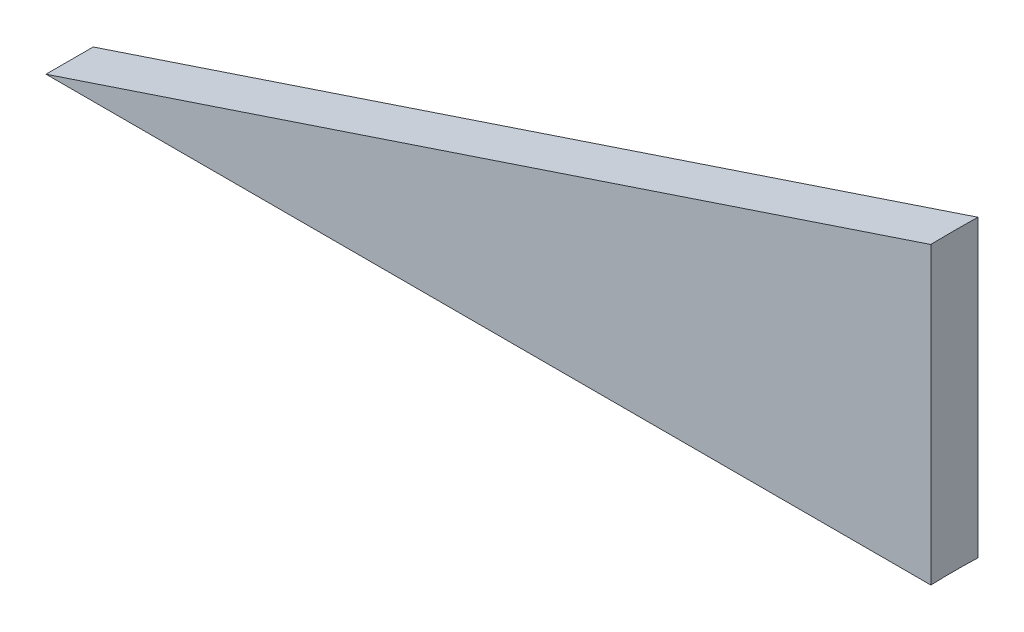
ISO-10303-21;
HEADER;
FILE_DESCRIPTION(('STEP AP214'),'2;1');
FILE_NAME('part.step','',(''),(''),'','','');
FILE_SCHEMA(('AUTOMOTIVE_DESIGN { 1 0 10303 214 1 1 1 1 }'));
ENDSEC;
DATA;
#1=APPLICATION_CONTEXT('core data for automotive mechanical design processes');
#2=APPLICATION_PROTOCOL_DEFINITION('international standard','automotive_design',2000,#1);
#3=PRODUCT_CONTEXT('',#1,'mechanical');
#4=PRODUCT('Part','Part','',(#3));
#5=PRODUCT_RELATED_PRODUCT_CATEGORY('part','',(#4));
#6=PRODUCT_DEFINITION_FORMATION('','',#4);
#7=PRODUCT_DEFINITION_CONTEXT('part definition',#1,'design');
#8=PRODUCT_DEFINITION('design','',#6,#7);
#9=PRODUCT_DEFINITION_SHAPE('','',#8);
#10=(LENGTH_UNIT() NAMED_UNIT(*) SI_UNIT(.MILLI.,.METRE.));
#11=(NAMED_UNIT(*) PLANE_ANGLE_UNIT() SI_UNIT($,.RADIAN.));
#12=(NAMED_UNIT(*) SI_UNIT($,.STERADIAN.) SOLID_ANGLE_UNIT());
#13=UNCERTAINTY_MEASURE_WITH_UNIT(LENGTH_MEASURE(1.E-05),#10,'distance_accuracy_value','');
#14=(GEOMETRIC_REPRESENTATION_CONTEXT(3) GLOBAL_UNCERTAINTY_ASSIGNED_CONTEXT((#13)) GLOBAL_UNIT_ASSIGNED_CONTEXT((#10,
#11,#12)) REPRESENTATION_CONTEXT('',''));
#15=CARTESIAN_POINT('',(0.,0.,0.));
#16=DIRECTION('',(0.,0.,1.));
#17=DIRECTION('',(1.,0.,0.));
#18=AXIS2_PLACEMENT_3D('',#15,#16,#17);
#19=CARTESIAN_POINT('',(150.,50.,8.));
#20=DIRECTION('',(0.316227766016838,-0.948683298050514,0.));
#21=DIRECTION('',(0.948683298050514,0.316227766016838,0.));
#22=AXIS2_PLACEMENT_3D('',#19,#20,#21);
#23=PLANE('',#22);
#24=DIRECTION('',(-0.948683298050514,-0.316227766016838,0.));
#25=VECTOR('',#24,1.);
#26=CARTESIAN_POINT('',(150.,50.,8.));
#27=LINE('',#26,#25);
#28=CARTESIAN_POINT('',(150.,50.,8.));
#29=VERTEX_POINT('',#28);
#30=CARTESIAN_POINT('',(0.,0.,8.));
#31=VERTEX_POINT('',#30);
#32=EDGE_CURVE('E78',#29,#31,#27,.T.);
#33=ORIENTED_EDGE('',*,*,#32,.F.);
#34=CARTESIAN_POINT('',(274.935983607606,91.645327869202,4.));
#35=DIRECTION('',(0.316227766016838,-0.948683298050514,0.));
#36=DIRECTION('',(-0.948683298050514,-0.316227766016838,0.));
#37=AXIS2_PLACEMENT_3D('',#34,#35,#36);
#38=ELLIPSE('',#37,131.761569173683,125.);
#39=CARTESIAN_POINT('',(150.,50.,0.));
#40=VERTEX_POINT('',#39);
#41=EDGE_CURVE('E67',#29,#40,#38,.T.);
#42=ORIENTED_EDGE('',*,*,#41,.T.);
#43=DIRECTION('',(-0.948683298050514,-0.316227766016838,0.));
#44=VECTOR('',#43,1.);
#45=CARTESIAN_POINT('',(150.,50.,0.));
#46=LINE('',#45,#44);
#47=CARTESIAN_POINT('',(0.,0.,0.));
#48=VERTEX_POINT('',#47);
#49=EDGE_CURVE('E84',#40,#48,#46,.T.);
#50=ORIENTED_EDGE('',*,*,#49,.T.);
#51=DIRECTION('',(0.,0.,-1.));
#52=VECTOR('',#51,1.);
#53=CARTESIAN_POINT('',(0.,0.,8.));
#54=LINE('',#53,#52);
#55=EDGE_CURVE('E11',#31,#48,#54,.T.);
#56=ORIENTED_EDGE('',*,*,#55,.F.);
#57=EDGE_LOOP('',(#33,#42,#50,#56));
#58=FACE_BOUND('',#57,.T.);
#59=ADVANCED_FACE('F32',(#58),#23,.F.);
#60=CARTESIAN_POINT('',(0.,0.,8.));
#61=DIRECTION('',(0.,1.,0.));
#62=DIRECTION('',(0.,0.,1.));
#63=AXIS2_PLACEMENT_3D('',#60,#61,#62);
#64=PLANE('',#63);
#65=DIRECTION('',(1.,0.,0.));
#66=VECTOR('',#65,1.);
#67=CARTESIAN_POINT('',(0.,0.,0.));
#68=LINE('',#67,#66);
#69=CARTESIAN_POINT('',(150.,0.,0.));
#70=VERTEX_POINT('',#69);
#71=EDGE_CURVE('E58',#48,#70,#68,.T.);
#72=ORIENTED_EDGE('',*,*,#71,.T.);
#73=CARTESIAN_POINT('',(274.935983607606,0.,4.));
#74=DIRECTION('',(0.,-1.,0.));
#75=DIRECTION('',(0.,0.,-1.));
#76=AXIS2_PLACEMENT_3D('',#73,#74,#75);
#77=CIRCLE('',#76,125.);
#78=CARTESIAN_POINT('',(150.,0.,8.));
#79=VERTEX_POINT('',#78);
#80=EDGE_CURVE('E71',#79,#70,#77,.T.);
#81=ORIENTED_EDGE('',*,*,#80,.F.);
#82=DIRECTION('',(1.,0.,0.));
#83=VECTOR('',#82,1.);
#84=CARTESIAN_POINT('',(0.,0.,8.));
#85=LINE('',#84,#83);
#86=EDGE_CURVE('E46',#31,#79,#85,.T.);
#87=ORIENTED_EDGE('',*,*,#86,.F.);
#88=ORIENTED_EDGE('',*,*,#55,.T.);
#89=EDGE_LOOP('',(#72,#81,#87,#88));
#90=FACE_BOUND('',#89,.T.);
#91=ADVANCED_FACE('F75',(#90),#64,.F.);
#92=CARTESIAN_POINT('',(0.,0.,8.));
#93=DIRECTION('',(0.,0.,-1.));
#94=DIRECTION('',(-1.,0.,0.));
#95=AXIS2_PLACEMENT_3D('',#92,#93,#94);
#96=PLANE('',#95);
#97=ORIENTED_EDGE('',*,*,#32,.T.);
#98=ORIENTED_EDGE('',*,*,#86,.T.);
#99=DIRECTION('',(0.,1.,0.));
#100=VECTOR('',#99,1.);
#101=CARTESIAN_POINT('',(150.,0.,8.));
#102=LINE('',#101,#100);
#103=EDGE_CURVE('E40',#79,#29,#102,.T.);
#104=ORIENTED_EDGE('',*,*,#103,.T.);
#105=EDGE_LOOP('',(#97,#98,#104));
#106=FACE_BOUND('',#105,.T.);
#107=ADVANCED_FACE('F77',(#106),#96,.F.);
#108=CARTESIAN_POINT('',(0.,0.,0.));
#109=DIRECTION('',(0.,0.,-1.));
#110=DIRECTION('',(-1.,0.,0.));
#111=AXIS2_PLACEMENT_3D('',#108,#109,#110);
#112=PLANE('',#111);
#113=ORIENTED_EDGE('',*,*,#49,.F.);
#114=DIRECTION('',(0.,1.,0.));
#115=VECTOR('',#114,1.);
#116=CARTESIAN_POINT('',(150.,0.,0.));
#117=LINE('',#116,#115);
#118=EDGE_CURVE('E63',#70,#40,#117,.T.);
#119=ORIENTED_EDGE('',*,*,#118,.F.);
#120=ORIENTED_EDGE('',*,*,#71,.F.);
#121=EDGE_LOOP('',(#113,#119,#120));
#122=FACE_BOUND('',#121,.T.);
#123=ADVANCED_FACE('F88',(#122),#112,.T.);
#124=CARTESIAN_POINT('',(274.935983607606,50.,4.));
#125=DIRECTION('',(0.,-1.,0.));
#126=DIRECTION('',(0.,0.,-1.));
#127=AXIS2_PLACEMENT_3D('',#124,#125,#126);
#128=CYLINDRICAL_SURFACE('',#127,125.);
#129=ORIENTED_EDGE('',*,*,#80,.T.);
#130=ORIENTED_EDGE('',*,*,#118,.T.);
#131=ORIENTED_EDGE('',*,*,#41,.F.);
#132=ORIENTED_EDGE('',*,*,#103,.F.);
#133=EDGE_LOOP('',(#129,#130,#131,#132));
#134=FACE_BOUND('',#133,.T.);
#135=ADVANCED_FACE('F70',(#134),#128,.F.);
#136=CLOSED_SHELL('',(#59,#91,#107,#123,#135));
#137=MANIFOLD_SOLID_BREP('B2',#136);
#138=ADVANCED_BREP_SHAPE_REPRESENTATION('',(#18,#137),#14);
#139=SHAPE_DEFINITION_REPRESENTATION(#9,#138);
ENDSEC;
END-ISO-10303-21;
